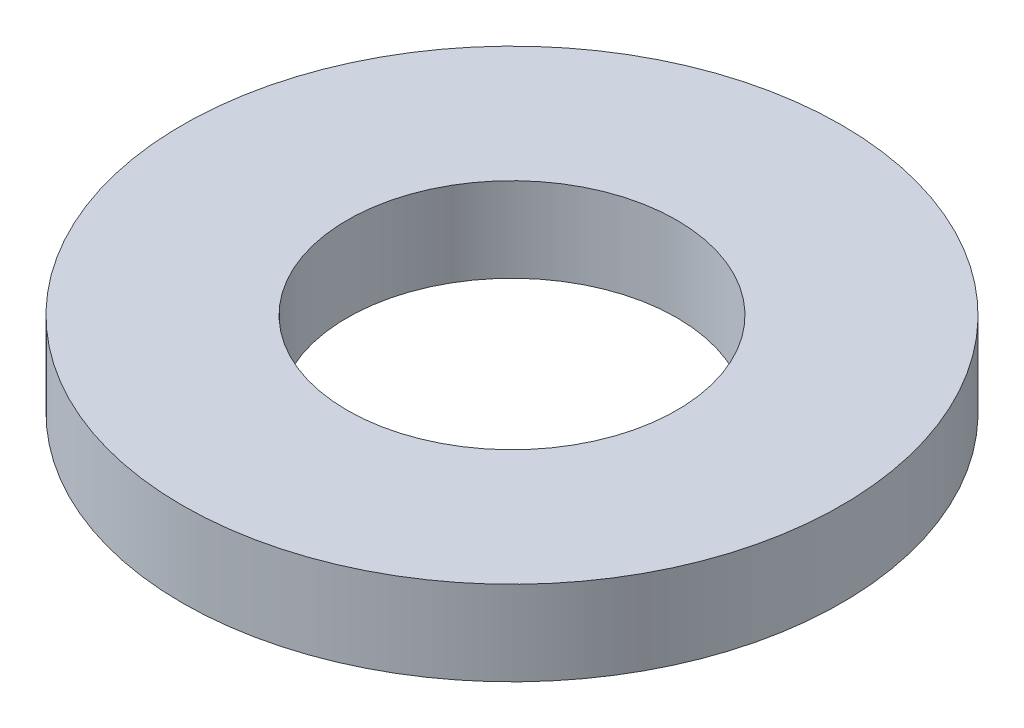
ISO-10303-21;
HEADER;
FILE_DESCRIPTION(('STEP AP214'),'2;1');
FILE_NAME('part.step','',(''),(''),'','','');
FILE_SCHEMA(('AUTOMOTIVE_DESIGN { 1 0 10303 214 1 1 1 1 }'));
ENDSEC;
DATA;
#1=APPLICATION_CONTEXT('core data for automotive mechanical design processes');
#2=APPLICATION_PROTOCOL_DEFINITION('international standard','automotive_design',2000,#1);
#3=PRODUCT_CONTEXT('',#1,'mechanical');
#4=PRODUCT('Part','Part','',(#3));
#5=PRODUCT_RELATED_PRODUCT_CATEGORY('part','',(#4));
#6=PRODUCT_DEFINITION_FORMATION('','',#4);
#7=PRODUCT_DEFINITION_CONTEXT('part definition',#1,'design');
#8=PRODUCT_DEFINITION('design','',#6,#7);
#9=PRODUCT_DEFINITION_SHAPE('','',#8);
#10=(LENGTH_UNIT() NAMED_UNIT(*) SI_UNIT(.MILLI.,.METRE.));
#11=(NAMED_UNIT(*) PLANE_ANGLE_UNIT() SI_UNIT($,.RADIAN.));
#12=(NAMED_UNIT(*) SI_UNIT($,.STERADIAN.) SOLID_ANGLE_UNIT());
#13=UNCERTAINTY_MEASURE_WITH_UNIT(LENGTH_MEASURE(1.E-05),#10,'distance_accuracy_value','');
#14=(GEOMETRIC_REPRESENTATION_CONTEXT(3) GLOBAL_UNCERTAINTY_ASSIGNED_CONTEXT((#13)) GLOBAL_UNIT_ASSIGNED_CONTEXT((#10,
#11,#12)) REPRESENTATION_CONTEXT('',''));
#15=CARTESIAN_POINT('',(0.,0.,0.));
#16=DIRECTION('',(0.,0.,1.));
#17=DIRECTION('',(1.,0.,0.));
#18=AXIS2_PLACEMENT_3D('',#15,#16,#17);
#19=CARTESIAN_POINT('',(0.,1.016,0.));
#20=DIRECTION('',(0.,-1.,0.));
#21=DIRECTION('',(0.,0.,-1.));
#22=AXIS2_PLACEMENT_3D('',#19,#20,#21);
#23=CYLINDRICAL_SURFACE('',#22,3.9624);
#24=CARTESIAN_POINT('',(0.,1.016,0.));
#25=DIRECTION('',(0.,1.,0.));
#26=DIRECTION('',(0.,0.,1.));
#27=AXIS2_PLACEMENT_3D('',#24,#25,#26);
#28=CIRCLE('',#27,3.9624);
#29=CARTESIAN_POINT('',(0.,1.016,3.9624));
#30=VERTEX_POINT('',#29);
#31=EDGE_CURVE('E10',#30,#30,#28,.T.);
#32=ORIENTED_EDGE('',*,*,#31,.F.);
#33=EDGE_LOOP('',(#32));
#34=FACE_BOUND('',#33,.T.);
#35=CARTESIAN_POINT('',(0.,0.,0.));
#36=DIRECTION('',(0.,1.,0.));
#37=DIRECTION('',(0.,0.,1.));
#38=AXIS2_PLACEMENT_3D('',#35,#36,#37);
#39=CIRCLE('',#38,3.9624);
#40=CARTESIAN_POINT('',(0.,0.,3.9624));
#41=VERTEX_POINT('',#40);
#42=EDGE_CURVE('E31',#41,#41,#39,.T.);
#43=ORIENTED_EDGE('',*,*,#42,.T.);
#44=EDGE_LOOP('',(#43));
#45=FACE_BOUND('',#44,.T.);
#46=ADVANCED_FACE('F28',(#34,#45),#23,.T.);
#47=CARTESIAN_POINT('',(0.,1.016,0.));
#48=DIRECTION('',(0.,1.,0.));
#49=DIRECTION('',(0.,0.,1.));
#50=AXIS2_PLACEMENT_3D('',#47,#48,#49);
#51=PLANE('',#50);
#52=CARTESIAN_POINT('',(0.,1.016,0.));
#53=DIRECTION('',(0.,1.,0.));
#54=DIRECTION('',(0.,0.,1.));
#55=AXIS2_PLACEMENT_3D('',#52,#53,#54);
#56=CIRCLE('',#55,1.9812);
#57=CARTESIAN_POINT('',(0.,1.016,1.9812));
#58=VERTEX_POINT('',#57);
#59=EDGE_CURVE('E40',#58,#58,#56,.T.);
#60=ORIENTED_EDGE('',*,*,#59,.F.);
#61=EDGE_LOOP('',(#60));
#62=FACE_BOUND('',#61,.T.);
#63=ORIENTED_EDGE('',*,*,#31,.T.);
#64=EDGE_LOOP('',(#63));
#65=FACE_BOUND('',#64,.T.);
#66=ADVANCED_FACE('F55',(#62,#65),#51,.T.);
#67=CARTESIAN_POINT('',(0.,0.,0.));
#68=DIRECTION('',(0.,1.,0.));
#69=DIRECTION('',(0.,0.,1.));
#70=AXIS2_PLACEMENT_3D('',#67,#68,#69);
#71=PLANE('',#70);
#72=CARTESIAN_POINT('',(0.,0.,0.));
#73=DIRECTION('',(0.,1.,0.));
#74=DIRECTION('',(0.,0.,1.));
#75=AXIS2_PLACEMENT_3D('',#72,#73,#74);
#76=CIRCLE('',#75,1.9812);
#77=CARTESIAN_POINT('',(0.,0.,1.9812));
#78=VERTEX_POINT('',#77);
#79=EDGE_CURVE('E38',#78,#78,#76,.T.);
#80=ORIENTED_EDGE('',*,*,#79,.T.);
#81=EDGE_LOOP('',(#80));
#82=FACE_BOUND('',#81,.T.);
#83=ORIENTED_EDGE('',*,*,#42,.F.);
#84=EDGE_LOOP('',(#83));
#85=FACE_BOUND('',#84,.T.);
#86=ADVANCED_FACE('F46',(#82,#85),#71,.F.);
#87=CARTESIAN_POINT('',(0.,0.,0.));
#88=DIRECTION('',(0.,1.,0.));
#89=DIRECTION('',(0.,0.,1.));
#90=AXIS2_PLACEMENT_3D('',#87,#88,#89);
#91=CYLINDRICAL_SURFACE('',#90,1.9812);
#92=ORIENTED_EDGE('',*,*,#79,.F.);
#93=EDGE_LOOP('',(#92));
#94=FACE_BOUND('',#93,.T.);
#95=ORIENTED_EDGE('',*,*,#59,.T.);
#96=EDGE_LOOP('',(#95));
#97=FACE_BOUND('',#96,.T.);
#98=ADVANCED_FACE('F49',(#94,#97),#91,.F.);
#99=CLOSED_SHELL('',(#46,#66,#86,#98));
#100=MANIFOLD_SOLID_BREP('B2',#99);
#101=ADVANCED_BREP_SHAPE_REPRESENTATION('',(#18,#100),#14);
#102=SHAPE_DEFINITION_REPRESENTATION(#9,#101);
ENDSEC;
END-ISO-10303-21;
